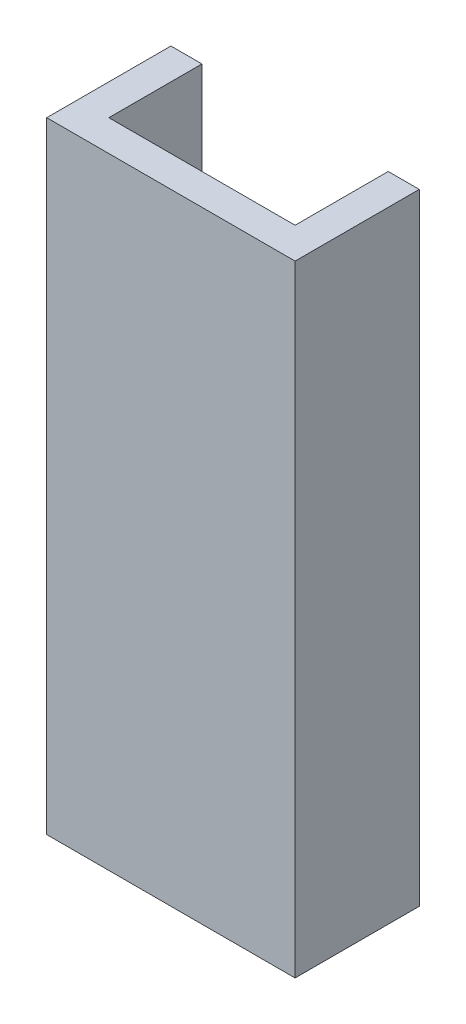
ISO-10303-21;
HEADER;
FILE_DESCRIPTION(('STEP AP214'),'2;1');
FILE_NAME('part.step','',(''),(''),'','','');
FILE_SCHEMA(('AUTOMOTIVE_DESIGN { 1 0 10303 214 1 1 1 1 }'));
ENDSEC;
DATA;
#1=APPLICATION_CONTEXT('core data for automotive mechanical design processes');
#2=APPLICATION_PROTOCOL_DEFINITION('international standard','automotive_design',2000,#1);
#3=PRODUCT_CONTEXT('',#1,'mechanical');
#4=PRODUCT('Part','Part','',(#3));
#5=PRODUCT_RELATED_PRODUCT_CATEGORY('part','',(#4));
#6=PRODUCT_DEFINITION_FORMATION('','',#4);
#7=PRODUCT_DEFINITION_CONTEXT('part definition',#1,'design');
#8=PRODUCT_DEFINITION('design','',#6,#7);
#9=PRODUCT_DEFINITION_SHAPE('','',#8);
#10=(LENGTH_UNIT() NAMED_UNIT(*) SI_UNIT(.MILLI.,.METRE.));
#11=(NAMED_UNIT(*) PLANE_ANGLE_UNIT() SI_UNIT($,.RADIAN.));
#12=(NAMED_UNIT(*) SI_UNIT($,.STERADIAN.) SOLID_ANGLE_UNIT());
#13=UNCERTAINTY_MEASURE_WITH_UNIT(LENGTH_MEASURE(1.E-05),#10,'distance_accuracy_value','');
#14=(GEOMETRIC_REPRESENTATION_CONTEXT(3) GLOBAL_UNCERTAINTY_ASSIGNED_CONTEXT((#13)) GLOBAL_UNIT_ASSIGNED_CONTEXT((#10,
#11,#12)) REPRESENTATION_CONTEXT('',''));
#15=CARTESIAN_POINT('',(0.,0.,0.));
#16=DIRECTION('',(0.,0.,1.));
#17=DIRECTION('',(1.,0.,0.));
#18=AXIS2_PLACEMENT_3D('',#15,#16,#17);
#19=CARTESIAN_POINT('',(20.,100.,0.));
#20=DIRECTION('',(-1.,0.,0.));
#21=DIRECTION('',(0.,0.,1.));
#22=AXIS2_PLACEMENT_3D('',#19,#20,#21);
#23=PLANE('',#22);
#24=DIRECTION('',(0.,0.,-1.));
#25=VECTOR('',#24,1.);
#26=CARTESIAN_POINT('',(20.,0.,0.));
#27=LINE('',#26,#25);
#28=CARTESIAN_POINT('',(20.,0.,0.));
#29=VERTEX_POINT('',#28);
#30=CARTESIAN_POINT('',(20.,0.,-20.));
#31=VERTEX_POINT('',#30);
#32=EDGE_CURVE('E140',#29,#31,#27,.T.);
#33=ORIENTED_EDGE('',*,*,#32,.T.);
#34=DIRECTION('',(0.,-1.,0.));
#35=VECTOR('',#34,1.);
#36=CARTESIAN_POINT('',(20.,100.,-20.));
#37=LINE('',#36,#35);
#38=CARTESIAN_POINT('',(20.,100.,-20.));
#39=VERTEX_POINT('',#38);
#40=EDGE_CURVE('E11',#39,#31,#37,.T.);
#41=ORIENTED_EDGE('',*,*,#40,.F.);
#42=DIRECTION('',(0.,0.,-1.));
#43=VECTOR('',#42,1.);
#44=CARTESIAN_POINT('',(20.,100.,0.));
#45=LINE('',#44,#43);
#46=CARTESIAN_POINT('',(20.,100.,0.));
#47=VERTEX_POINT('',#46);
#48=EDGE_CURVE('E162',#47,#39,#45,.T.);
#49=ORIENTED_EDGE('',*,*,#48,.F.);
#50=DIRECTION('',(0.,-1.,0.));
#51=VECTOR('',#50,1.);
#52=CARTESIAN_POINT('',(20.,100.,0.));
#53=LINE('',#52,#51);
#54=EDGE_CURVE('E136',#47,#29,#53,.T.);
#55=ORIENTED_EDGE('',*,*,#54,.T.);
#56=EDGE_LOOP('',(#33,#41,#49,#55));
#57=FACE_BOUND('',#56,.T.);
#58=ADVANCED_FACE('F39',(#57),#23,.F.);
#59=CARTESIAN_POINT('',(20.,100.,-20.));
#60=DIRECTION('',(0.,0.,1.));
#61=DIRECTION('',(1.,0.,0.));
#62=AXIS2_PLACEMENT_3D('',#59,#60,#61);
#63=PLANE('',#62);
#64=DIRECTION('',(-1.,0.,0.));
#65=VECTOR('',#64,1.);
#66=CARTESIAN_POINT('',(20.,0.,-20.));
#67=LINE('',#66,#65);
#68=CARTESIAN_POINT('',(15.,0.,-20.));
#69=VERTEX_POINT('',#68);
#70=EDGE_CURVE('E144',#31,#69,#67,.T.);
#71=ORIENTED_EDGE('',*,*,#70,.T.);
#72=DIRECTION('',(0.,-1.,0.));
#73=VECTOR('',#72,1.);
#74=CARTESIAN_POINT('',(15.,100.,-20.));
#75=LINE('',#74,#73);
#76=CARTESIAN_POINT('',(15.,100.,-20.));
#77=VERTEX_POINT('',#76);
#78=EDGE_CURVE('E48',#77,#69,#75,.T.);
#79=ORIENTED_EDGE('',*,*,#78,.F.);
#80=DIRECTION('',(-1.,0.,0.));
#81=VECTOR('',#80,1.);
#82=CARTESIAN_POINT('',(20.,100.,-20.));
#83=LINE('',#82,#81);
#84=EDGE_CURVE('E99',#39,#77,#83,.T.);
#85=ORIENTED_EDGE('',*,*,#84,.F.);
#86=ORIENTED_EDGE('',*,*,#40,.T.);
#87=EDGE_LOOP('',(#71,#79,#85,#86));
#88=FACE_BOUND('',#87,.T.);
#89=ADVANCED_FACE('F208',(#88),#63,.F.);
#90=CARTESIAN_POINT('',(15.,100.,-20.));
#91=DIRECTION('',(1.,0.,0.));
#92=DIRECTION('',(0.,0.,-1.));
#93=AXIS2_PLACEMENT_3D('',#90,#91,#92);
#94=PLANE('',#93);
#95=DIRECTION('',(0.,0.,1.));
#96=VECTOR('',#95,1.);
#97=CARTESIAN_POINT('',(15.,0.,-20.));
#98=LINE('',#97,#96);
#99=CARTESIAN_POINT('',(15.,0.,-5.));
#100=VERTEX_POINT('',#99);
#101=EDGE_CURVE('E147',#69,#100,#98,.T.);
#102=ORIENTED_EDGE('',*,*,#101,.T.);
#103=DIRECTION('',(0.,-1.,0.));
#104=VECTOR('',#103,1.);
#105=CARTESIAN_POINT('',(15.,100.,-5.));
#106=LINE('',#105,#104);
#107=CARTESIAN_POINT('',(15.,100.,-5.));
#108=VERTEX_POINT('',#107);
#109=EDGE_CURVE('E173',#108,#100,#106,.T.);
#110=ORIENTED_EDGE('',*,*,#109,.F.);
#111=DIRECTION('',(0.,0.,1.));
#112=VECTOR('',#111,1.);
#113=CARTESIAN_POINT('',(15.,100.,-20.));
#114=LINE('',#113,#112);
#115=EDGE_CURVE('E183',#77,#108,#114,.T.);
#116=ORIENTED_EDGE('',*,*,#115,.F.);
#117=ORIENTED_EDGE('',*,*,#78,.T.);
#118=EDGE_LOOP('',(#102,#110,#116,#117));
#119=FACE_BOUND('',#118,.T.);
#120=ADVANCED_FACE('F181',(#119),#94,.F.);
#121=CARTESIAN_POINT('',(15.,100.,-5.));
#122=DIRECTION('',(0.,0.,1.));
#123=DIRECTION('',(1.,0.,0.));
#124=AXIS2_PLACEMENT_3D('',#121,#122,#123);
#125=PLANE('',#124);
#126=DIRECTION('',(-1.,0.,0.));
#127=VECTOR('',#126,1.);
#128=CARTESIAN_POINT('',(15.,0.,-5.));
#129=LINE('',#128,#127);
#130=CARTESIAN_POINT('',(-15.,0.,-5.));
#131=VERTEX_POINT('',#130);
#132=EDGE_CURVE('E150',#100,#131,#129,.T.);
#133=ORIENTED_EDGE('',*,*,#132,.T.);
#134=DIRECTION('',(0.,-1.,0.));
#135=VECTOR('',#134,1.);
#136=CARTESIAN_POINT('',(-15.,100.,-5.));
#137=LINE('',#136,#135);
#138=CARTESIAN_POINT('',(-15.,100.,-5.));
#139=VERTEX_POINT('',#138);
#140=EDGE_CURVE('E169',#139,#131,#137,.T.);
#141=ORIENTED_EDGE('',*,*,#140,.F.);
#142=DIRECTION('',(-1.,0.,0.));
#143=VECTOR('',#142,1.);
#144=CARTESIAN_POINT('',(15.,100.,-5.));
#145=LINE('',#144,#143);
#146=EDGE_CURVE('E196',#108,#139,#145,.T.);
#147=ORIENTED_EDGE('',*,*,#146,.F.);
#148=ORIENTED_EDGE('',*,*,#109,.T.);
#149=EDGE_LOOP('',(#133,#141,#147,#148));
#150=FACE_BOUND('',#149,.T.);
#151=ADVANCED_FACE('F191',(#150),#125,.F.);
#152=CARTESIAN_POINT('',(-15.,100.,-20.));
#153=DIRECTION('',(-1.,0.,0.));
#154=DIRECTION('',(0.,0.,1.));
#155=AXIS2_PLACEMENT_3D('',#152,#153,#154);
#156=PLANE('',#155);
#157=DIRECTION('',(0.,0.,-1.));
#158=VECTOR('',#157,1.);
#159=CARTESIAN_POINT('',(-15.,0.,-20.));
#160=LINE('',#159,#158);
#161=CARTESIAN_POINT('',(-15.,0.,-20.));
#162=VERTEX_POINT('',#161);
#163=EDGE_CURVE('E153',#131,#162,#160,.T.);
#164=ORIENTED_EDGE('',*,*,#163,.T.);
#165=DIRECTION('',(0.,-1.,0.));
#166=VECTOR('',#165,1.);
#167=CARTESIAN_POINT('',(-15.,100.,-20.));
#168=LINE('',#167,#166);
#169=CARTESIAN_POINT('',(-15.,100.,-20.));
#170=VERTEX_POINT('',#169);
#171=EDGE_CURVE('E129',#170,#162,#168,.T.);
#172=ORIENTED_EDGE('',*,*,#171,.F.);
#173=DIRECTION('',(0.,0.,-1.));
#174=VECTOR('',#173,1.);
#175=CARTESIAN_POINT('',(-15.,100.,-20.));
#176=LINE('',#175,#174);
#177=EDGE_CURVE('E118',#139,#170,#176,.T.);
#178=ORIENTED_EDGE('',*,*,#177,.F.);
#179=ORIENTED_EDGE('',*,*,#140,.T.);
#180=EDGE_LOOP('',(#164,#172,#178,#179));
#181=FACE_BOUND('',#180,.T.);
#182=ADVANCED_FACE('F194',(#181),#156,.F.);
#183=CARTESIAN_POINT('',(-20.,100.,-20.));
#184=DIRECTION('',(0.,0.,1.));
#185=DIRECTION('',(1.,0.,0.));
#186=AXIS2_PLACEMENT_3D('',#183,#184,#185);
#187=PLANE('',#186);
#188=DIRECTION('',(-1.,0.,0.));
#189=VECTOR('',#188,1.);
#190=CARTESIAN_POINT('',(-20.,0.,-20.));
#191=LINE('',#190,#189);
#192=CARTESIAN_POINT('',(-20.,0.,-20.));
#193=VERTEX_POINT('',#192);
#194=EDGE_CURVE('E127',#162,#193,#191,.T.);
#195=ORIENTED_EDGE('',*,*,#194,.T.);
#196=DIRECTION('',(0.,-1.,0.));
#197=VECTOR('',#196,1.);
#198=CARTESIAN_POINT('',(-20.,100.,-20.));
#199=LINE('',#198,#197);
#200=CARTESIAN_POINT('',(-20.,100.,-20.));
#201=VERTEX_POINT('',#200);
#202=EDGE_CURVE('E124',#201,#193,#199,.T.);
#203=ORIENTED_EDGE('',*,*,#202,.F.);
#204=DIRECTION('',(-1.,0.,0.));
#205=VECTOR('',#204,1.);
#206=CARTESIAN_POINT('',(-20.,100.,-20.));
#207=LINE('',#206,#205);
#208=EDGE_CURVE('E112',#170,#201,#207,.T.);
#209=ORIENTED_EDGE('',*,*,#208,.F.);
#210=ORIENTED_EDGE('',*,*,#171,.T.);
#211=EDGE_LOOP('',(#195,#203,#209,#210));
#212=FACE_BOUND('',#211,.T.);
#213=ADVANCED_FACE('F125',(#212),#187,.F.);
#214=CARTESIAN_POINT('',(-20.,100.,0.));
#215=DIRECTION('',(1.,0.,0.));
#216=DIRECTION('',(0.,0.,-1.));
#217=AXIS2_PLACEMENT_3D('',#214,#215,#216);
#218=PLANE('',#217);
#219=DIRECTION('',(0.,0.,1.));
#220=VECTOR('',#219,1.);
#221=CARTESIAN_POINT('',(-20.,0.,0.));
#222=LINE('',#221,#220);
#223=CARTESIAN_POINT('',(-20.,0.,0.));
#224=VERTEX_POINT('',#223);
#225=EDGE_CURVE('E85',#193,#224,#222,.T.);
#226=ORIENTED_EDGE('',*,*,#225,.T.);
#227=DIRECTION('',(0.,-1.,0.));
#228=VECTOR('',#227,1.);
#229=CARTESIAN_POINT('',(-20.,100.,0.));
#230=LINE('',#229,#228);
#231=CARTESIAN_POINT('',(-20.,100.,0.));
#232=VERTEX_POINT('',#231);
#233=EDGE_CURVE('E130',#232,#224,#230,.T.);
#234=ORIENTED_EDGE('',*,*,#233,.F.);
#235=DIRECTION('',(0.,0.,1.));
#236=VECTOR('',#235,1.);
#237=CARTESIAN_POINT('',(-20.,100.,0.));
#238=LINE('',#237,#236);
#239=EDGE_CURVE('E116',#201,#232,#238,.T.);
#240=ORIENTED_EDGE('',*,*,#239,.F.);
#241=ORIENTED_EDGE('',*,*,#202,.T.);
#242=EDGE_LOOP('',(#226,#234,#240,#241));
#243=FACE_BOUND('',#242,.T.);
#244=ADVANCED_FACE('F132',(#243),#218,.F.);
#245=CARTESIAN_POINT('',(-20.,100.,0.));
#246=DIRECTION('',(0.,0.,-1.));
#247=DIRECTION('',(-1.,0.,0.));
#248=AXIS2_PLACEMENT_3D('',#245,#246,#247);
#249=PLANE('',#248);
#250=DIRECTION('',(1.,0.,0.));
#251=VECTOR('',#250,1.);
#252=CARTESIAN_POINT('',(-20.,0.,0.));
#253=LINE('',#252,#251);
#254=EDGE_CURVE('E91',#224,#29,#253,.T.);
#255=ORIENTED_EDGE('',*,*,#254,.T.);
#256=ORIENTED_EDGE('',*,*,#54,.F.);
#257=DIRECTION('',(1.,0.,0.));
#258=VECTOR('',#257,1.);
#259=CARTESIAN_POINT('',(-20.,100.,0.));
#260=LINE('',#259,#258);
#261=EDGE_CURVE('E56',#232,#47,#260,.T.);
#262=ORIENTED_EDGE('',*,*,#261,.F.);
#263=ORIENTED_EDGE('',*,*,#233,.T.);
#264=EDGE_LOOP('',(#255,#256,#262,#263));
#265=FACE_BOUND('',#264,.T.);
#266=ADVANCED_FACE('F224',(#265),#249,.F.);
#267=CARTESIAN_POINT('',(0.,100.,0.));
#268=DIRECTION('',(0.,1.,0.));
#269=DIRECTION('',(0.,0.,1.));
#270=AXIS2_PLACEMENT_3D('',#267,#268,#269);
#271=PLANE('',#270);
#272=ORIENTED_EDGE('',*,*,#48,.T.);
#273=ORIENTED_EDGE('',*,*,#84,.T.);
#274=ORIENTED_EDGE('',*,*,#115,.T.);
#275=ORIENTED_EDGE('',*,*,#146,.T.);
#276=ORIENTED_EDGE('',*,*,#177,.T.);
#277=ORIENTED_EDGE('',*,*,#208,.T.);
#278=ORIENTED_EDGE('',*,*,#239,.T.);
#279=ORIENTED_EDGE('',*,*,#261,.T.);
#280=EDGE_LOOP('',(#272,#273,#274,#275,#276,#277,#278,#279));
#281=FACE_BOUND('',#280,.T.);
#282=ADVANCED_FACE('F114',(#281),#271,.T.);
#283=CARTESIAN_POINT('',(0.,0.,0.));
#284=DIRECTION('',(0.,1.,0.));
#285=DIRECTION('',(0.,0.,1.));
#286=AXIS2_PLACEMENT_3D('',#283,#284,#285);
#287=PLANE('',#286);
#288=ORIENTED_EDGE('',*,*,#32,.F.);
#289=ORIENTED_EDGE('',*,*,#254,.F.);
#290=ORIENTED_EDGE('',*,*,#225,.F.);
#291=ORIENTED_EDGE('',*,*,#194,.F.);
#292=ORIENTED_EDGE('',*,*,#163,.F.);
#293=ORIENTED_EDGE('',*,*,#132,.F.);
#294=ORIENTED_EDGE('',*,*,#101,.F.);
#295=ORIENTED_EDGE('',*,*,#70,.F.);
#296=EDGE_LOOP('',(#288,#289,#290,#291,#292,#293,#294,#295));
#297=FACE_BOUND('',#296,.T.);
#298=ADVANCED_FACE('F187',(#297),#287,.F.);
#299=CLOSED_SHELL('',(#58,#89,#120,#151,#182,#213,#244,#266,#282,#298));
#300=MANIFOLD_SOLID_BREP('B2',#299);
#301=ADVANCED_BREP_SHAPE_REPRESENTATION('',(#18,#300),#14);
#302=SHAPE_DEFINITION_REPRESENTATION(#9,#301);
ENDSEC;
END-ISO-10303-21;
